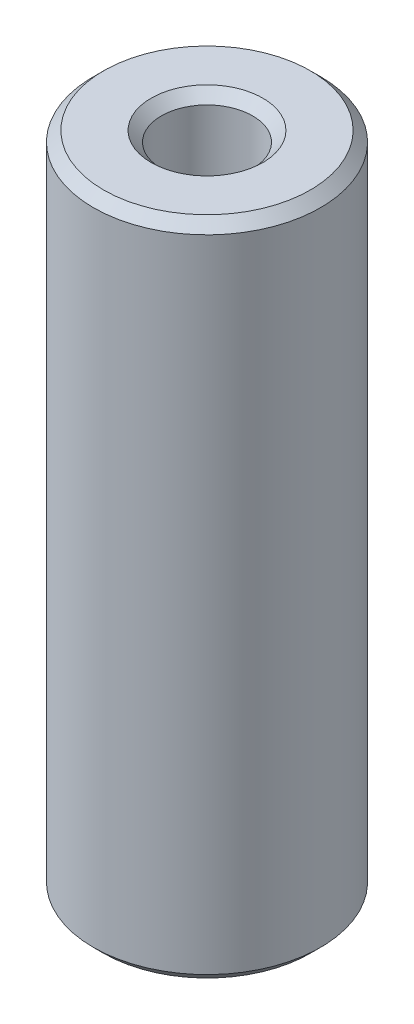
ISO-10303-21;
HEADER;
FILE_DESCRIPTION(('STEP AP214'),'2;1');
FILE_NAME('part.step','',(''),(''),'','','');
FILE_SCHEMA(('AUTOMOTIVE_DESIGN { 1 0 10303 214 1 1 1 1 }'));
ENDSEC;
DATA;
#1=APPLICATION_CONTEXT('core data for automotive mechanical design processes');
#2=APPLICATION_PROTOCOL_DEFINITION('international standard','automotive_design',2000,#1);
#3=PRODUCT_CONTEXT('',#1,'mechanical');
#4=PRODUCT('Part','Part','',(#3));
#5=PRODUCT_RELATED_PRODUCT_CATEGORY('part','',(#4));
#6=PRODUCT_DEFINITION_FORMATION('','',#4);
#7=PRODUCT_DEFINITION_CONTEXT('part definition',#1,'design');
#8=PRODUCT_DEFINITION('design','',#6,#7);
#9=PRODUCT_DEFINITION_SHAPE('','',#8);
#10=(LENGTH_UNIT() NAMED_UNIT(*) SI_UNIT(.MILLI.,.METRE.));
#11=(NAMED_UNIT(*) PLANE_ANGLE_UNIT() SI_UNIT($,.RADIAN.));
#12=(NAMED_UNIT(*) SI_UNIT($,.STERADIAN.) SOLID_ANGLE_UNIT());
#13=UNCERTAINTY_MEASURE_WITH_UNIT(LENGTH_MEASURE(1.E-05),#10,'distance_accuracy_value','');
#14=(GEOMETRIC_REPRESENTATION_CONTEXT(3) GLOBAL_UNCERTAINTY_ASSIGNED_CONTEXT((#13)) GLOBAL_UNIT_ASSIGNED_CONTEXT((#10,
#11,#12)) REPRESENTATION_CONTEXT('',''));
#15=CARTESIAN_POINT('',(0.,0.,0.));
#16=DIRECTION('',(0.,0.,1.));
#17=DIRECTION('',(1.,0.,0.));
#18=AXIS2_PLACEMENT_3D('',#15,#16,#17);
#19=CARTESIAN_POINT('',(0.,72.771207772254,0.));
#20=DIRECTION('',(0.,-1.,0.));
#21=DIRECTION('',(0.,0.,-1.));
#22=AXIS2_PLACEMENT_3D('',#19,#20,#21);
#23=CYLINDRICAL_SURFACE('',#22,12.5);
#24=CARTESIAN_POINT('',(0.,1.12342354845706,0.));
#25=DIRECTION('',(0.,1.,0.));
#26=DIRECTION('',(0.,0.,1.));
#27=AXIS2_PLACEMENT_3D('',#24,#25,#26);
#28=CIRCLE('',#27,12.5);
#29=CARTESIAN_POINT('',(0.,1.12342354845706,12.5));
#30=VERTEX_POINT('',#29);
#31=EDGE_CURVE('E10',#30,#30,#28,.T.);
#32=ORIENTED_EDGE('',*,*,#31,.T.);
#33=EDGE_LOOP('',(#32));
#34=FACE_BOUND('',#33,.T.);
#35=CARTESIAN_POINT('',(0.,71.647784223797,0.));
#36=DIRECTION('',(0.,1.,0.));
#37=DIRECTION('',(0.,0.,1.));
#38=AXIS2_PLACEMENT_3D('',#35,#36,#37);
#39=CIRCLE('',#38,12.5);
#40=CARTESIAN_POINT('',(0.,71.647784223797,12.5));
#41=VERTEX_POINT('',#40);
#42=EDGE_CURVE('E50',#41,#41,#39,.F.);
#43=ORIENTED_EDGE('',*,*,#42,.T.);
#44=EDGE_LOOP('',(#43));
#45=FACE_BOUND('',#44,.T.);
#46=ADVANCED_FACE('F39',(#34,#45),#23,.T.);
#47=CARTESIAN_POINT('',(0.,72.771207772254,0.));
#48=DIRECTION('',(0.,1.,0.));
#49=DIRECTION('',(0.,0.,1.));
#50=AXIS2_PLACEMENT_3D('',#47,#48,#49);
#51=PLANE('',#50);
#52=CARTESIAN_POINT('',(0.,72.771207772254,0.));
#53=DIRECTION('',(0.,1.,0.));
#54=DIRECTION('',(0.,0.,1.));
#55=AXIS2_PLACEMENT_3D('',#52,#53,#54);
#56=CIRCLE('',#55,6.1471865235444);
#57=CARTESIAN_POINT('',(0.,72.771207772254,6.1471865235444));
#58=VERTEX_POINT('',#57);
#59=EDGE_CURVE('E58',#58,#58,#56,.F.);
#60=ORIENTED_EDGE('',*,*,#59,.T.);
#61=EDGE_LOOP('',(#60));
#62=FACE_BOUND('',#61,.T.);
#63=CARTESIAN_POINT('',(0.,72.771207772254,0.));
#64=DIRECTION('',(0.,1.,0.));
#65=DIRECTION('',(0.,0.,1.));
#66=AXIS2_PLACEMENT_3D('',#63,#64,#65);
#67=CIRCLE('',#66,11.3765764515429);
#68=CARTESIAN_POINT('',(0.,72.771207772254,11.3765764515429));
#69=VERTEX_POINT('',#68);
#70=EDGE_CURVE('E61',#69,#69,#67,.T.);
#71=ORIENTED_EDGE('',*,*,#70,.T.);
#72=EDGE_LOOP('',(#71));
#73=FACE_BOUND('',#72,.T.);
#74=ADVANCED_FACE('F88',(#62,#73),#51,.T.);
#75=CARTESIAN_POINT('',(0.,0.,0.));
#76=DIRECTION('',(0.,1.,0.));
#77=DIRECTION('',(0.,0.,1.));
#78=AXIS2_PLACEMENT_3D('',#75,#76,#77);
#79=PLANE('',#78);
#80=CARTESIAN_POINT('',(0.,0.,0.));
#81=DIRECTION('',(0.,1.,0.));
#82=DIRECTION('',(0.,0.,1.));
#83=AXIS2_PLACEMENT_3D('',#80,#81,#82);
#84=CIRCLE('',#83,6.14718652354439);
#85=CARTESIAN_POINT('',(0.,0.,6.14718652354439));
#86=VERTEX_POINT('',#85);
#87=EDGE_CURVE('E51',#86,#86,#84,.T.);
#88=ORIENTED_EDGE('',*,*,#87,.T.);
#89=EDGE_LOOP('',(#88));
#90=FACE_BOUND('',#89,.T.);
#91=CARTESIAN_POINT('',(0.,0.,0.));
#92=DIRECTION('',(0.,1.,0.));
#93=DIRECTION('',(0.,0.,1.));
#94=AXIS2_PLACEMENT_3D('',#91,#92,#93);
#95=CIRCLE('',#94,11.3765764515429);
#96=CARTESIAN_POINT('',(0.,0.,11.3765764515429));
#97=VERTEX_POINT('',#96);
#98=EDGE_CURVE('E54',#97,#97,#95,.F.);
#99=ORIENTED_EDGE('',*,*,#98,.T.);
#100=EDGE_LOOP('',(#99));
#101=FACE_BOUND('',#100,.T.);
#102=ADVANCED_FACE('F83',(#90,#101),#79,.F.);
#103=CARTESIAN_POINT('',(0.,72.771207772254,0.));
#104=DIRECTION('',(0.,-1.,0.));
#105=DIRECTION('',(0.,0.,-1.));
#106=AXIS2_PLACEMENT_3D('',#103,#104,#105);
#107=CYLINDRICAL_SURFACE('',#106,5.02376297508737);
#108=CARTESIAN_POINT('',(0.,71.647784223797,0.));
#109=DIRECTION('',(0.,1.,0.));
#110=DIRECTION('',(0.,0.,1.));
#111=AXIS2_PLACEMENT_3D('',#108,#109,#110);
#112=CIRCLE('',#111,5.02376297508737);
#113=CARTESIAN_POINT('',(0.,71.647784223797,5.02376297508737));
#114=VERTEX_POINT('',#113);
#115=EDGE_CURVE('E67',#114,#114,#112,.T.);
#116=ORIENTED_EDGE('',*,*,#115,.T.);
#117=EDGE_LOOP('',(#116));
#118=FACE_BOUND('',#117,.T.);
#119=CARTESIAN_POINT('',(0.,1.12342354845703,0.));
#120=DIRECTION('',(0.,1.,0.));
#121=DIRECTION('',(0.,0.,1.));
#122=AXIS2_PLACEMENT_3D('',#119,#120,#121);
#123=CIRCLE('',#122,5.02376297508737);
#124=CARTESIAN_POINT('',(0.,1.12342354845703,5.02376297508737));
#125=VERTEX_POINT('',#124);
#126=EDGE_CURVE('E69',#125,#125,#123,.F.);
#127=ORIENTED_EDGE('',*,*,#126,.T.);
#128=EDGE_LOOP('',(#127));
#129=FACE_BOUND('',#128,.T.);
#130=ADVANCED_FACE('F71',(#118,#129),#107,.F.);
#131=CARTESIAN_POINT('',(0.,71.647784223797,0.));
#132=DIRECTION('',(0.,1.,0.));
#133=DIRECTION('',(0.,0.,1.));
#134=AXIS2_PLACEMENT_3D('',#131,#132,#133);
#135=CONICAL_SURFACE('',#134,5.02376297508737,0.785398163397449);
#136=ORIENTED_EDGE('',*,*,#59,.F.);
#137=EDGE_LOOP('',(#136));
#138=FACE_BOUND('',#137,.T.);
#139=ORIENTED_EDGE('',*,*,#115,.F.);
#140=EDGE_LOOP('',(#139));
#141=FACE_BOUND('',#140,.T.);
#142=ADVANCED_FACE('F77',(#138,#141),#135,.F.);
#143=CARTESIAN_POINT('',(0.,0.,0.));
#144=DIRECTION('',(0.,-1.,0.));
#145=DIRECTION('',(0.,0.,-1.));
#146=AXIS2_PLACEMENT_3D('',#143,#144,#145);
#147=CONICAL_SURFACE('',#146,6.14718652354439,0.785398163397446);
#148=ORIENTED_EDGE('',*,*,#126,.F.);
#149=EDGE_LOOP('',(#148));
#150=FACE_BOUND('',#149,.T.);
#151=ORIENTED_EDGE('',*,*,#87,.F.);
#152=EDGE_LOOP('',(#151));
#153=FACE_BOUND('',#152,.T.);
#154=ADVANCED_FACE('F73',(#150,#153),#147,.F.);
#155=CARTESIAN_POINT('',(0.,1.12342354845706,0.));
#156=DIRECTION('',(0.,1.,0.));
#157=DIRECTION('',(0.,0.,1.));
#158=AXIS2_PLACEMENT_3D('',#155,#156,#157);
#159=CONICAL_SURFACE('',#158,12.5,0.785398163397452);
#160=ORIENTED_EDGE('',*,*,#98,.F.);
#161=EDGE_LOOP('',(#160));
#162=FACE_BOUND('',#161,.T.);
#163=ORIENTED_EDGE('',*,*,#31,.F.);
#164=EDGE_LOOP('',(#163));
#165=FACE_BOUND('',#164,.T.);
#166=ADVANCED_FACE('F76',(#162,#165),#159,.T.);
#167=CARTESIAN_POINT('',(0.,72.771207772254,0.));
#168=DIRECTION('',(0.,-1.,0.));
#169=DIRECTION('',(0.,0.,-1.));
#170=AXIS2_PLACEMENT_3D('',#167,#168,#169);
#171=CONICAL_SURFACE('',#170,11.3765764515429,0.785398163397447);
#172=ORIENTED_EDGE('',*,*,#42,.F.);
#173=EDGE_LOOP('',(#172));
#174=FACE_BOUND('',#173,.T.);
#175=ORIENTED_EDGE('',*,*,#70,.F.);
#176=EDGE_LOOP('',(#175));
#177=FACE_BOUND('',#176,.T.);
#178=ADVANCED_FACE('F45',(#174,#177),#171,.T.);
#179=CLOSED_SHELL('',(#46,#74,#102,#130,#142,#154,#166,#178));
#180=MANIFOLD_SOLID_BREP('B2',#179);
#181=ADVANCED_BREP_SHAPE_REPRESENTATION('',(#18,#180),#14);
#182=SHAPE_DEFINITION_REPRESENTATION(#9,#181);
ENDSEC;
END-ISO-10303-21;
